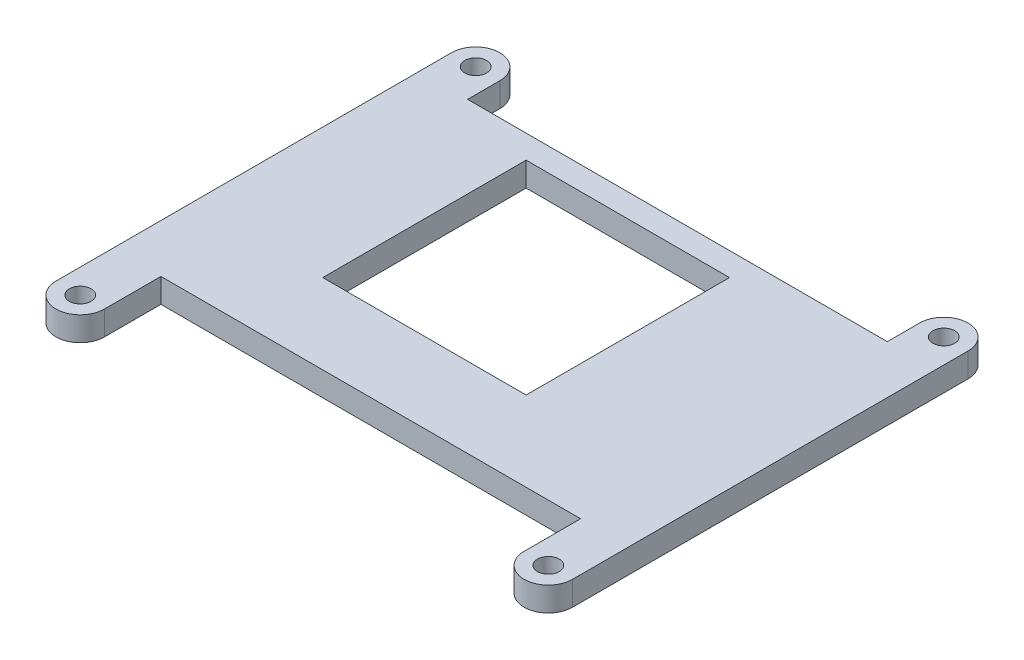
ISO-10303-21;
HEADER;
FILE_DESCRIPTION(('STEP AP214'),'2;1');
FILE_NAME('part.step','',(''),(''),'','','');
FILE_SCHEMA(('AUTOMOTIVE_DESIGN { 1 0 10303 214 1 1 1 1 }'));
ENDSEC;
DATA;
#1=APPLICATION_CONTEXT('core data for automotive mechanical design processes');
#2=APPLICATION_PROTOCOL_DEFINITION('international standard','automotive_design',2000,#1);
#3=PRODUCT_CONTEXT('',#1,'mechanical');
#4=PRODUCT('Part','Part','',(#3));
#5=PRODUCT_RELATED_PRODUCT_CATEGORY('part','',(#4));
#6=PRODUCT_DEFINITION_FORMATION('','',#4);
#7=PRODUCT_DEFINITION_CONTEXT('part definition',#1,'design');
#8=PRODUCT_DEFINITION('design','',#6,#7);
#9=PRODUCT_DEFINITION_SHAPE('','',#8);
#10=(LENGTH_UNIT() NAMED_UNIT(*) SI_UNIT(.MILLI.,.METRE.));
#11=(NAMED_UNIT(*) PLANE_ANGLE_UNIT() SI_UNIT($,.RADIAN.));
#12=(NAMED_UNIT(*) SI_UNIT($,.STERADIAN.) SOLID_ANGLE_UNIT());
#13=UNCERTAINTY_MEASURE_WITH_UNIT(LENGTH_MEASURE(1.E-05),#10,'distance_accuracy_value','');
#14=(GEOMETRIC_REPRESENTATION_CONTEXT(3) GLOBAL_UNCERTAINTY_ASSIGNED_CONTEXT((#13)) GLOBAL_UNIT_ASSIGNED_CONTEXT((#10,
#11,#12)) REPRESENTATION_CONTEXT('',''));
#15=CARTESIAN_POINT('',(0.,0.,0.));
#16=DIRECTION('',(0.,0.,1.));
#17=DIRECTION('',(1.,0.,0.));
#18=AXIS2_PLACEMENT_3D('',#15,#16,#17);
#19=CARTESIAN_POINT('',(-25.75,3.,-19.5));
#20=DIRECTION('',(0.,1.,0.));
#21=DIRECTION('',(0.,0.,1.));
#22=AXIS2_PLACEMENT_3D('',#19,#20,#21);
#23=PLANE('',#22);
#24=CARTESIAN_POINT('',(32.25,3.,-19.5));
#25=DIRECTION('',(0.,1.,0.));
#26=DIRECTION('',(0.,0.,1.));
#27=AXIS2_PLACEMENT_3D('',#24,#25,#26);
#28=CIRCLE('',#27,1.35);
#29=CARTESIAN_POINT('',(32.25,3.,-18.15));
#30=VERTEX_POINT('',#29);
#31=EDGE_CURVE('E527',#30,#30,#28,.T.);
#32=ORIENTED_EDGE('',*,*,#31,.F.);
#33=EDGE_LOOP('',(#32));
#34=FACE_BOUND('',#33,.T.);
#35=CARTESIAN_POINT('',(-25.75,3.,-19.5));
#36=DIRECTION('',(0.,1.,0.));
#37=DIRECTION('',(0.,0.,1.));
#38=AXIS2_PLACEMENT_3D('',#35,#36,#37);
#39=CIRCLE('',#38,1.35);
#40=CARTESIAN_POINT('',(-25.75,3.,-18.15));
#41=VERTEX_POINT('',#40);
#42=EDGE_CURVE('E177',#41,#41,#39,.T.);
#43=ORIENTED_EDGE('',*,*,#42,.F.);
#44=EDGE_LOOP('',(#43));
#45=FACE_BOUND('',#44,.T.);
#46=CARTESIAN_POINT('',(-25.75,3.,-19.5));
#47=DIRECTION('',(0.,1.,0.));
#48=DIRECTION('',(0.,0.,1.));
#49=AXIS2_PLACEMENT_3D('',#46,#47,#48);
#50=CIRCLE('',#49,3.00000000000001);
#51=CARTESIAN_POINT('',(-22.75,3.,-19.5));
#52=VERTEX_POINT('',#51);
#53=CARTESIAN_POINT('',(-28.75,3.,-19.5));
#54=VERTEX_POINT('',#53);
#55=EDGE_CURVE('E187',#52,#54,#50,.T.);
#56=ORIENTED_EDGE('',*,*,#55,.T.);
#57=DIRECTION('',(0.,0.,1.));
#58=VECTOR('',#57,1.);
#59=CARTESIAN_POINT('',(-28.75,3.,-19.5));
#60=LINE('',#59,#58);
#61=CARTESIAN_POINT('',(-28.75,3.,29.5));
#62=VERTEX_POINT('',#61);
#63=EDGE_CURVE('E190',#54,#62,#60,.T.);
#64=ORIENTED_EDGE('',*,*,#63,.T.);
#65=CARTESIAN_POINT('',(-25.75,3.,29.5));
#66=DIRECTION('',(0.,1.,0.));
#67=DIRECTION('',(0.,0.,1.));
#68=AXIS2_PLACEMENT_3D('',#65,#66,#67);
#69=CIRCLE('',#68,3.);
#70=CARTESIAN_POINT('',(-22.75,3.,29.5));
#71=VERTEX_POINT('',#70);
#72=EDGE_CURVE('E193',#62,#71,#69,.T.);
#73=ORIENTED_EDGE('',*,*,#72,.T.);
#74=DIRECTION('',(0.,0.,-1.));
#75=VECTOR('',#74,1.);
#76=CARTESIAN_POINT('',(-22.75,3.,29.5));
#77=LINE('',#76,#75);
#78=CARTESIAN_POINT('',(-22.75,3.,22.5));
#79=VERTEX_POINT('',#78);
#80=EDGE_CURVE('E195',#71,#79,#77,.T.);
#81=ORIENTED_EDGE('',*,*,#80,.T.);
#82=DIRECTION('',(1.,0.,0.));
#83=VECTOR('',#82,1.);
#84=CARTESIAN_POINT('',(-22.75,3.,22.5));
#85=LINE('',#84,#83);
#86=CARTESIAN_POINT('',(29.25,3.,22.5));
#87=VERTEX_POINT('',#86);
#88=EDGE_CURVE('E197',#79,#87,#85,.T.);
#89=ORIENTED_EDGE('',*,*,#88,.T.);
#90=DIRECTION('',(0.,0.,1.));
#91=VECTOR('',#90,1.);
#92=CARTESIAN_POINT('',(29.25,3.,22.5));
#93=LINE('',#92,#91);
#94=CARTESIAN_POINT('',(29.25,3.,29.5));
#95=VERTEX_POINT('',#94);
#96=EDGE_CURVE('E199',#87,#95,#93,.T.);
#97=ORIENTED_EDGE('',*,*,#96,.T.);
#98=CARTESIAN_POINT('',(32.25,3.,29.5));
#99=DIRECTION('',(0.,1.,0.));
#100=DIRECTION('',(0.,0.,1.));
#101=AXIS2_PLACEMENT_3D('',#98,#99,#100);
#102=CIRCLE('',#101,3.);
#103=CARTESIAN_POINT('',(35.25,3.,29.5));
#104=VERTEX_POINT('',#103);
#105=EDGE_CURVE('E201',#95,#104,#102,.T.);
#106=ORIENTED_EDGE('',*,*,#105,.T.);
#107=DIRECTION('',(0.,0.,-1.));
#108=VECTOR('',#107,1.);
#109=CARTESIAN_POINT('',(35.25,3.,-19.5));
#110=LINE('',#109,#108);
#111=CARTESIAN_POINT('',(35.25,3.,-19.5));
#112=VERTEX_POINT('',#111);
#113=EDGE_CURVE('E203',#104,#112,#110,.T.);
#114=ORIENTED_EDGE('',*,*,#113,.T.);
#115=CARTESIAN_POINT('',(32.25,3.,-19.5));
#116=DIRECTION('',(0.,1.,0.));
#117=DIRECTION('',(0.,0.,1.));
#118=AXIS2_PLACEMENT_3D('',#115,#116,#117);
#119=CIRCLE('',#118,2.99999999999999);
#120=CARTESIAN_POINT('',(29.25,3.,-19.5));
#121=VERTEX_POINT('',#120);
#122=EDGE_CURVE('E205',#112,#121,#119,.T.);
#123=ORIENTED_EDGE('',*,*,#122,.T.);
#124=DIRECTION('',(0.,0.,1.));
#125=VECTOR('',#124,1.);
#126=CARTESIAN_POINT('',(29.25,3.,-15.5));
#127=LINE('',#126,#125);
#128=CARTESIAN_POINT('',(29.25,3.,-15.5));
#129=VERTEX_POINT('',#128);
#130=EDGE_CURVE('E207',#121,#129,#127,.T.);
#131=ORIENTED_EDGE('',*,*,#130,.T.);
#132=DIRECTION('',(-1.,0.,0.));
#133=VECTOR('',#132,1.);
#134=CARTESIAN_POINT('',(-22.75,3.,-15.5));
#135=LINE('',#134,#133);
#136=CARTESIAN_POINT('',(-22.75,3.,-15.5));
#137=VERTEX_POINT('',#136);
#138=EDGE_CURVE('E209',#129,#137,#135,.T.);
#139=ORIENTED_EDGE('',*,*,#138,.T.);
#140=DIRECTION('',(0.,0.,-1.));
#141=VECTOR('',#140,1.);
#142=CARTESIAN_POINT('',(-22.75,3.,-15.5));
#143=LINE('',#142,#141);
#144=EDGE_CURVE('E211',#137,#52,#143,.T.);
#145=ORIENTED_EDGE('',*,*,#144,.T.);
#146=EDGE_LOOP('',(#56,#64,#73,#81,#89,#97,#106,#114,#123,#131,#139,#145));
#147=FACE_BOUND('',#146,.T.);
#148=DIRECTION('',(1.,0.,0.));
#149=VECTOR('',#148,1.);
#150=CARTESIAN_POINT('',(-12.6,3.,12.6));
#151=LINE('',#150,#149);
#152=CARTESIAN_POINT('',(-12.6,3.,12.6));
#153=VERTEX_POINT('',#152);
#154=CARTESIAN_POINT('',(12.6,3.,12.6));
#155=VERTEX_POINT('',#154);
#156=EDGE_CURVE('E156',#153,#155,#151,.T.);
#157=ORIENTED_EDGE('',*,*,#156,.F.);
#158=DIRECTION('',(0.,0.,1.));
#159=VECTOR('',#158,1.);
#160=CARTESIAN_POINT('',(-12.6,3.,-12.6));
#161=LINE('',#160,#159);
#162=CARTESIAN_POINT('',(-12.6,3.,-12.6));
#163=VERTEX_POINT('',#162);
#164=EDGE_CURVE('E148',#163,#153,#161,.T.);
#165=ORIENTED_EDGE('',*,*,#164,.F.);
#166=DIRECTION('',(-1.,0.,0.));
#167=VECTOR('',#166,1.);
#168=CARTESIAN_POINT('',(-12.6,3.,-12.6));
#169=LINE('',#168,#167);
#170=CARTESIAN_POINT('',(12.6,3.,-12.6));
#171=VERTEX_POINT('',#170);
#172=EDGE_CURVE('E171',#171,#163,#169,.T.);
#173=ORIENTED_EDGE('',*,*,#172,.F.);
#174=DIRECTION('',(0.,0.,-1.));
#175=VECTOR('',#174,1.);
#176=CARTESIAN_POINT('',(12.6,3.,-12.6));
#177=LINE('',#176,#175);
#178=EDGE_CURVE('E169',#155,#171,#177,.T.);
#179=ORIENTED_EDGE('',*,*,#178,.F.);
#180=EDGE_LOOP('',(#157,#165,#173,#179));
#181=FACE_BOUND('',#180,.T.);
#182=CARTESIAN_POINT('',(-25.75,3.,29.5));
#183=DIRECTION('',(0.,1.,0.));
#184=DIRECTION('',(0.,0.,1.));
#185=AXIS2_PLACEMENT_3D('',#182,#183,#184);
#186=CIRCLE('',#185,1.35);
#187=CARTESIAN_POINT('',(-25.75,3.,30.85));
#188=VERTEX_POINT('',#187);
#189=EDGE_CURVE('E533',#188,#188,#186,.T.);
#190=ORIENTED_EDGE('',*,*,#189,.F.);
#191=EDGE_LOOP('',(#190));
#192=FACE_BOUND('',#191,.T.);
#193=CARTESIAN_POINT('',(32.25,3.,29.5));
#194=DIRECTION('',(0.,1.,0.));
#195=DIRECTION('',(0.,0.,1.));
#196=AXIS2_PLACEMENT_3D('',#193,#194,#195);
#197=CIRCLE('',#196,1.35);
#198=CARTESIAN_POINT('',(32.25,3.,30.85));
#199=VERTEX_POINT('',#198);
#200=EDGE_CURVE('E518',#199,#199,#197,.T.);
#201=ORIENTED_EDGE('',*,*,#200,.F.);
#202=EDGE_LOOP('',(#201));
#203=FACE_BOUND('',#202,.T.);
#204=ADVANCED_FACE('F35',(#34,#45,#147,#181,#192,#203),#23,.T.);
#205=CARTESIAN_POINT('',(-25.75,0.,-19.5));
#206=DIRECTION('',(0.,1.,0.));
#207=DIRECTION('',(0.,0.,1.));
#208=AXIS2_PLACEMENT_3D('',#205,#206,#207);
#209=PLANE('',#208);
#210=CARTESIAN_POINT('',(-25.75,0.,-19.5));
#211=DIRECTION('',(0.,1.,0.));
#212=DIRECTION('',(0.,0.,1.));
#213=AXIS2_PLACEMENT_3D('',#210,#211,#212);
#214=CIRCLE('',#213,3.00000000000001);
#215=CARTESIAN_POINT('',(-22.75,0.,-19.5));
#216=VERTEX_POINT('',#215);
#217=CARTESIAN_POINT('',(-28.75,0.,-19.5));
#218=VERTEX_POINT('',#217);
#219=EDGE_CURVE('E164',#216,#218,#214,.T.);
#220=ORIENTED_EDGE('',*,*,#219,.F.);
#221=DIRECTION('',(0.,0.,-1.));
#222=VECTOR('',#221,1.);
#223=CARTESIAN_POINT('',(-22.75,0.,-15.5));
#224=LINE('',#223,#222);
#225=CARTESIAN_POINT('',(-22.75,0.,-15.5));
#226=VERTEX_POINT('',#225);
#227=EDGE_CURVE('E191',#226,#216,#224,.T.);
#228=ORIENTED_EDGE('',*,*,#227,.F.);
#229=DIRECTION('',(-1.,0.,0.));
#230=VECTOR('',#229,1.);
#231=CARTESIAN_POINT('',(-22.75,0.,-15.5));
#232=LINE('',#231,#230);
#233=CARTESIAN_POINT('',(29.25,0.,-15.5));
#234=VERTEX_POINT('',#233);
#235=EDGE_CURVE('E234',#234,#226,#232,.T.);
#236=ORIENTED_EDGE('',*,*,#235,.F.);
#237=DIRECTION('',(0.,0.,1.));
#238=VECTOR('',#237,1.);
#239=CARTESIAN_POINT('',(29.25,0.,-15.5));
#240=LINE('',#239,#238);
#241=CARTESIAN_POINT('',(29.25,0.,-19.5));
#242=VERTEX_POINT('',#241);
#243=EDGE_CURVE('E232',#242,#234,#240,.T.);
#244=ORIENTED_EDGE('',*,*,#243,.F.);
#245=CARTESIAN_POINT('',(32.25,0.,-19.5));
#246=DIRECTION('',(0.,1.,0.));
#247=DIRECTION('',(0.,0.,1.));
#248=AXIS2_PLACEMENT_3D('',#245,#246,#247);
#249=CIRCLE('',#248,2.99999999999999);
#250=CARTESIAN_POINT('',(35.25,0.,-19.5));
#251=VERTEX_POINT('',#250);
#252=EDGE_CURVE('E230',#251,#242,#249,.T.);
#253=ORIENTED_EDGE('',*,*,#252,.F.);
#254=DIRECTION('',(0.,0.,-1.));
#255=VECTOR('',#254,1.);
#256=CARTESIAN_POINT('',(35.25,0.,-19.5));
#257=LINE('',#256,#255);
#258=CARTESIAN_POINT('',(35.25,0.,29.5));
#259=VERTEX_POINT('',#258);
#260=EDGE_CURVE('E228',#259,#251,#257,.T.);
#261=ORIENTED_EDGE('',*,*,#260,.F.);
#262=CARTESIAN_POINT('',(32.25,0.,29.5));
#263=DIRECTION('',(0.,1.,0.));
#264=DIRECTION('',(0.,0.,1.));
#265=AXIS2_PLACEMENT_3D('',#262,#263,#264);
#266=CIRCLE('',#265,3.);
#267=CARTESIAN_POINT('',(29.25,0.,29.5));
#268=VERTEX_POINT('',#267);
#269=EDGE_CURVE('E226',#268,#259,#266,.T.);
#270=ORIENTED_EDGE('',*,*,#269,.F.);
#271=DIRECTION('',(0.,0.,1.));
#272=VECTOR('',#271,1.);
#273=CARTESIAN_POINT('',(29.25,0.,22.5));
#274=LINE('',#273,#272);
#275=CARTESIAN_POINT('',(29.25,0.,22.5));
#276=VERTEX_POINT('',#275);
#277=EDGE_CURVE('E224',#276,#268,#274,.T.);
#278=ORIENTED_EDGE('',*,*,#277,.F.);
#279=DIRECTION('',(1.,0.,0.));
#280=VECTOR('',#279,1.);
#281=CARTESIAN_POINT('',(-22.75,0.,22.5));
#282=LINE('',#281,#280);
#283=CARTESIAN_POINT('',(-22.75,0.,22.5));
#284=VERTEX_POINT('',#283);
#285=EDGE_CURVE('E222',#284,#276,#282,.T.);
#286=ORIENTED_EDGE('',*,*,#285,.F.);
#287=DIRECTION('',(0.,0.,-1.));
#288=VECTOR('',#287,1.);
#289=CARTESIAN_POINT('',(-22.75,0.,29.5));
#290=LINE('',#289,#288);
#291=CARTESIAN_POINT('',(-22.75,0.,29.5));
#292=VERTEX_POINT('',#291);
#293=EDGE_CURVE('E220',#292,#284,#290,.T.);
#294=ORIENTED_EDGE('',*,*,#293,.F.);
#295=CARTESIAN_POINT('',(-25.75,0.,29.5));
#296=DIRECTION('',(0.,1.,0.));
#297=DIRECTION('',(0.,0.,1.));
#298=AXIS2_PLACEMENT_3D('',#295,#296,#297);
#299=CIRCLE('',#298,3.);
#300=CARTESIAN_POINT('',(-28.75,0.,29.5));
#301=VERTEX_POINT('',#300);
#302=EDGE_CURVE('E218',#301,#292,#299,.T.);
#303=ORIENTED_EDGE('',*,*,#302,.F.);
#304=DIRECTION('',(0.,0.,1.));
#305=VECTOR('',#304,1.);
#306=CARTESIAN_POINT('',(-28.75,0.,-19.5));
#307=LINE('',#306,#305);
#308=EDGE_CURVE('E216',#218,#301,#307,.T.);
#309=ORIENTED_EDGE('',*,*,#308,.F.);
#310=EDGE_LOOP('',(#220,#228,#236,#244,#253,#261,#270,#278,#286,#294,#303,#309));
#311=FACE_BOUND('',#310,.T.);
#312=DIRECTION('',(0.,0.,1.));
#313=VECTOR('',#312,1.);
#314=CARTESIAN_POINT('',(-12.6,0.,-12.6));
#315=LINE('',#314,#313);
#316=CARTESIAN_POINT('',(-12.6,0.,-12.6));
#317=VERTEX_POINT('',#316);
#318=CARTESIAN_POINT('',(-12.6,0.,12.6));
#319=VERTEX_POINT('',#318);
#320=EDGE_CURVE('E58',#317,#319,#315,.T.);
#321=ORIENTED_EDGE('',*,*,#320,.T.);
#322=DIRECTION('',(1.,0.,0.));
#323=VECTOR('',#322,1.);
#324=CARTESIAN_POINT('',(-12.6,0.,12.6));
#325=LINE('',#324,#323);
#326=CARTESIAN_POINT('',(12.6,0.,12.6));
#327=VERTEX_POINT('',#326);
#328=EDGE_CURVE('E163',#319,#327,#325,.T.);
#329=ORIENTED_EDGE('',*,*,#328,.T.);
#330=DIRECTION('',(0.,0.,-1.));
#331=VECTOR('',#330,1.);
#332=CARTESIAN_POINT('',(12.6,0.,-12.6));
#333=LINE('',#332,#331);
#334=CARTESIAN_POINT('',(12.6,0.,-12.6));
#335=VERTEX_POINT('',#334);
#336=EDGE_CURVE('E179',#327,#335,#333,.T.);
#337=ORIENTED_EDGE('',*,*,#336,.T.);
#338=DIRECTION('',(-1.,0.,0.));
#339=VECTOR('',#338,1.);
#340=CARTESIAN_POINT('',(-12.6,0.,-12.6));
#341=LINE('',#340,#339);
#342=EDGE_CURVE('E157',#335,#317,#341,.T.);
#343=ORIENTED_EDGE('',*,*,#342,.T.);
#344=EDGE_LOOP('',(#321,#329,#337,#343));
#345=FACE_BOUND('',#344,.T.);
#346=CARTESIAN_POINT('',(-25.75,0.,-19.5));
#347=DIRECTION('',(0.,1.,0.));
#348=DIRECTION('',(0.,0.,1.));
#349=AXIS2_PLACEMENT_3D('',#346,#347,#348);
#350=CIRCLE('',#349,1.35);
#351=CARTESIAN_POINT('',(-25.75,0.,-18.15));
#352=VERTEX_POINT('',#351);
#353=EDGE_CURVE('E536',#352,#352,#350,.T.);
#354=ORIENTED_EDGE('',*,*,#353,.T.);
#355=EDGE_LOOP('',(#354));
#356=FACE_BOUND('',#355,.T.);
#357=CARTESIAN_POINT('',(-25.75,0.,29.5));
#358=DIRECTION('',(0.,1.,0.));
#359=DIRECTION('',(0.,0.,1.));
#360=AXIS2_PLACEMENT_3D('',#357,#358,#359);
#361=CIRCLE('',#360,1.35);
#362=CARTESIAN_POINT('',(-25.75,0.,30.85));
#363=VERTEX_POINT('',#362);
#364=EDGE_CURVE('E530',#363,#363,#361,.T.);
#365=ORIENTED_EDGE('',*,*,#364,.T.);
#366=EDGE_LOOP('',(#365));
#367=FACE_BOUND('',#366,.T.);
#368=CARTESIAN_POINT('',(32.25,0.,-19.5));
#369=DIRECTION('',(0.,1.,0.));
#370=DIRECTION('',(0.,0.,1.));
#371=AXIS2_PLACEMENT_3D('',#368,#369,#370);
#372=CIRCLE('',#371,1.35);
#373=CARTESIAN_POINT('',(32.25,0.,-18.15));
#374=VERTEX_POINT('',#373);
#375=EDGE_CURVE('E524',#374,#374,#372,.T.);
#376=ORIENTED_EDGE('',*,*,#375,.T.);
#377=EDGE_LOOP('',(#376));
#378=FACE_BOUND('',#377,.T.);
#379=CARTESIAN_POINT('',(32.25,0.,29.5));
#380=DIRECTION('',(0.,1.,0.));
#381=DIRECTION('',(0.,0.,1.));
#382=AXIS2_PLACEMENT_3D('',#379,#380,#381);
#383=CIRCLE('',#382,1.35);
#384=CARTESIAN_POINT('',(32.25,0.,30.85));
#385=VERTEX_POINT('',#384);
#386=EDGE_CURVE('E521',#385,#385,#383,.T.);
#387=ORIENTED_EDGE('',*,*,#386,.T.);
#388=EDGE_LOOP('',(#387));
#389=FACE_BOUND('',#388,.T.);
#390=ADVANCED_FACE('F276',(#311,#345,#356,#367,#378,#389),#209,.F.);
#391=CARTESIAN_POINT('',(-25.75,3.,-19.5));
#392=DIRECTION('',(0.,-1.,0.));
#393=DIRECTION('',(0.,0.,-1.));
#394=AXIS2_PLACEMENT_3D('',#391,#392,#393);
#395=CYLINDRICAL_SURFACE('',#394,3.00000000000001);
#396=ORIENTED_EDGE('',*,*,#219,.T.);
#397=DIRECTION('',(0.,-1.,0.));
#398=VECTOR('',#397,1.);
#399=CARTESIAN_POINT('',(-28.75,3.,-19.5));
#400=LINE('',#399,#398);
#401=EDGE_CURVE('E11',#54,#218,#400,.T.);
#402=ORIENTED_EDGE('',*,*,#401,.F.);
#403=ORIENTED_EDGE('',*,*,#55,.F.);
#404=DIRECTION('',(0.,-1.,0.));
#405=VECTOR('',#404,1.);
#406=CARTESIAN_POINT('',(-22.75,3.,-19.5));
#407=LINE('',#406,#405);
#408=EDGE_CURVE('E213',#52,#216,#407,.T.);
#409=ORIENTED_EDGE('',*,*,#408,.T.);
#410=EDGE_LOOP('',(#396,#402,#403,#409));
#411=FACE_BOUND('',#410,.T.);
#412=ADVANCED_FACE('F37',(#411),#395,.T.);
#413=CARTESIAN_POINT('',(-28.75,3.,-19.5));
#414=DIRECTION('',(1.,0.,0.));
#415=DIRECTION('',(0.,0.,-1.));
#416=AXIS2_PLACEMENT_3D('',#413,#414,#415);
#417=PLANE('',#416);
#418=ORIENTED_EDGE('',*,*,#308,.T.);
#419=DIRECTION('',(0.,-1.,0.));
#420=VECTOR('',#419,1.);
#421=CARTESIAN_POINT('',(-28.75,3.,29.5));
#422=LINE('',#421,#420);
#423=EDGE_CURVE('E43',#62,#301,#422,.T.);
#424=ORIENTED_EDGE('',*,*,#423,.F.);
#425=ORIENTED_EDGE('',*,*,#63,.F.);
#426=ORIENTED_EDGE('',*,*,#401,.T.);
#427=EDGE_LOOP('',(#418,#424,#425,#426));
#428=FACE_BOUND('',#427,.T.);
#429=ADVANCED_FACE('F293',(#428),#417,.F.);
#430=CARTESIAN_POINT('',(-25.75,3.,29.5));
#431=DIRECTION('',(0.,-1.,0.));
#432=DIRECTION('',(0.,0.,-1.));
#433=AXIS2_PLACEMENT_3D('',#430,#431,#432);
#434=CYLINDRICAL_SURFACE('',#433,3.);
#435=ORIENTED_EDGE('',*,*,#302,.T.);
#436=DIRECTION('',(0.,-1.,0.));
#437=VECTOR('',#436,1.);
#438=CARTESIAN_POINT('',(-22.75,3.,29.5));
#439=LINE('',#438,#437);
#440=EDGE_CURVE('E263',#71,#292,#439,.T.);
#441=ORIENTED_EDGE('',*,*,#440,.F.);
#442=ORIENTED_EDGE('',*,*,#72,.F.);
#443=ORIENTED_EDGE('',*,*,#423,.T.);
#444=EDGE_LOOP('',(#435,#441,#442,#443));
#445=FACE_BOUND('',#444,.T.);
#446=ADVANCED_FACE('F270',(#445),#434,.T.);
#447=CARTESIAN_POINT('',(-22.75,3.,29.5));
#448=DIRECTION('',(-1.,0.,0.));
#449=DIRECTION('',(0.,0.,1.));
#450=AXIS2_PLACEMENT_3D('',#447,#448,#449);
#451=PLANE('',#450);
#452=ORIENTED_EDGE('',*,*,#293,.T.);
#453=DIRECTION('',(0.,-1.,0.));
#454=VECTOR('',#453,1.);
#455=CARTESIAN_POINT('',(-22.75,3.,22.5));
#456=LINE('',#455,#454);
#457=EDGE_CURVE('E260',#79,#284,#456,.T.);
#458=ORIENTED_EDGE('',*,*,#457,.F.);
#459=ORIENTED_EDGE('',*,*,#80,.F.);
#460=ORIENTED_EDGE('',*,*,#440,.T.);
#461=EDGE_LOOP('',(#452,#458,#459,#460));
#462=FACE_BOUND('',#461,.T.);
#463=ADVANCED_FACE('F282',(#462),#451,.F.);
#464=CARTESIAN_POINT('',(-22.75,3.,22.5));
#465=DIRECTION('',(0.,0.,-1.));
#466=DIRECTION('',(-1.,0.,0.));
#467=AXIS2_PLACEMENT_3D('',#464,#465,#466);
#468=PLANE('',#467);
#469=ORIENTED_EDGE('',*,*,#285,.T.);
#470=DIRECTION('',(0.,-1.,0.));
#471=VECTOR('',#470,1.);
#472=CARTESIAN_POINT('',(29.25,3.,22.5));
#473=LINE('',#472,#471);
#474=EDGE_CURVE('E257',#87,#276,#473,.T.);
#475=ORIENTED_EDGE('',*,*,#474,.F.);
#476=ORIENTED_EDGE('',*,*,#88,.F.);
#477=ORIENTED_EDGE('',*,*,#457,.T.);
#478=EDGE_LOOP('',(#469,#475,#476,#477));
#479=FACE_BOUND('',#478,.T.);
#480=ADVANCED_FACE('F286',(#479),#468,.F.);
#481=CARTESIAN_POINT('',(29.25,3.,22.5));
#482=DIRECTION('',(1.,0.,0.));
#483=DIRECTION('',(0.,0.,-1.));
#484=AXIS2_PLACEMENT_3D('',#481,#482,#483);
#485=PLANE('',#484);
#486=ORIENTED_EDGE('',*,*,#277,.T.);
#487=DIRECTION('',(0.,-1.,0.));
#488=VECTOR('',#487,1.);
#489=CARTESIAN_POINT('',(29.25,3.,29.5));
#490=LINE('',#489,#488);
#491=EDGE_CURVE('E254',#95,#268,#490,.T.);
#492=ORIENTED_EDGE('',*,*,#491,.F.);
#493=ORIENTED_EDGE('',*,*,#96,.F.);
#494=ORIENTED_EDGE('',*,*,#474,.T.);
#495=EDGE_LOOP('',(#486,#492,#493,#494));
#496=FACE_BOUND('',#495,.T.);
#497=ADVANCED_FACE('F326',(#496),#485,.F.);
#498=CARTESIAN_POINT('',(32.25,3.,29.5));
#499=DIRECTION('',(0.,-1.,0.));
#500=DIRECTION('',(0.,0.,-1.));
#501=AXIS2_PLACEMENT_3D('',#498,#499,#500);
#502=CYLINDRICAL_SURFACE('',#501,3.);
#503=ORIENTED_EDGE('',*,*,#269,.T.);
#504=DIRECTION('',(0.,-1.,0.));
#505=VECTOR('',#504,1.);
#506=CARTESIAN_POINT('',(35.25,3.,29.5));
#507=LINE('',#506,#505);
#508=EDGE_CURVE('E251',#104,#259,#507,.T.);
#509=ORIENTED_EDGE('',*,*,#508,.F.);
#510=ORIENTED_EDGE('',*,*,#105,.F.);
#511=ORIENTED_EDGE('',*,*,#491,.T.);
#512=EDGE_LOOP('',(#503,#509,#510,#511));
#513=FACE_BOUND('',#512,.T.);
#514=ADVANCED_FACE('F324',(#513),#502,.T.);
#515=CARTESIAN_POINT('',(35.25,3.,-19.5));
#516=DIRECTION('',(-1.,0.,0.));
#517=DIRECTION('',(0.,0.,1.));
#518=AXIS2_PLACEMENT_3D('',#515,#516,#517);
#519=PLANE('',#518);
#520=ORIENTED_EDGE('',*,*,#260,.T.);
#521=DIRECTION('',(0.,-1.,0.));
#522=VECTOR('',#521,1.);
#523=CARTESIAN_POINT('',(35.25,3.,-19.5));
#524=LINE('',#523,#522);
#525=EDGE_CURVE('E248',#112,#251,#524,.T.);
#526=ORIENTED_EDGE('',*,*,#525,.F.);
#527=ORIENTED_EDGE('',*,*,#113,.F.);
#528=ORIENTED_EDGE('',*,*,#508,.T.);
#529=EDGE_LOOP('',(#520,#526,#527,#528));
#530=FACE_BOUND('',#529,.T.);
#531=ADVANCED_FACE('F320',(#530),#519,.F.);
#532=CARTESIAN_POINT('',(32.25,3.,-19.5));
#533=DIRECTION('',(0.,-1.,0.));
#534=DIRECTION('',(0.,0.,-1.));
#535=AXIS2_PLACEMENT_3D('',#532,#533,#534);
#536=CYLINDRICAL_SURFACE('',#535,2.99999999999999);
#537=ORIENTED_EDGE('',*,*,#252,.T.);
#538=DIRECTION('',(0.,-1.,0.));
#539=VECTOR('',#538,1.);
#540=CARTESIAN_POINT('',(29.25,3.,-19.5));
#541=LINE('',#540,#539);
#542=EDGE_CURVE('E245',#121,#242,#541,.T.);
#543=ORIENTED_EDGE('',*,*,#542,.F.);
#544=ORIENTED_EDGE('',*,*,#122,.F.);
#545=ORIENTED_EDGE('',*,*,#525,.T.);
#546=EDGE_LOOP('',(#537,#543,#544,#545));
#547=FACE_BOUND('',#546,.T.);
#548=ADVANCED_FACE('F315',(#547),#536,.T.);
#549=CARTESIAN_POINT('',(29.25,3.,-15.5));
#550=DIRECTION('',(1.,0.,0.));
#551=DIRECTION('',(0.,0.,-1.));
#552=AXIS2_PLACEMENT_3D('',#549,#550,#551);
#553=PLANE('',#552);
#554=ORIENTED_EDGE('',*,*,#243,.T.);
#555=DIRECTION('',(0.,-1.,0.));
#556=VECTOR('',#555,1.);
#557=CARTESIAN_POINT('',(29.25,3.,-15.5));
#558=LINE('',#557,#556);
#559=EDGE_CURVE('E242',#129,#234,#558,.T.);
#560=ORIENTED_EDGE('',*,*,#559,.F.);
#561=ORIENTED_EDGE('',*,*,#130,.F.);
#562=ORIENTED_EDGE('',*,*,#542,.T.);
#563=EDGE_LOOP('',(#554,#560,#561,#562));
#564=FACE_BOUND('',#563,.T.);
#565=ADVANCED_FACE('F309',(#564),#553,.F.);
#566=CARTESIAN_POINT('',(-22.75,3.,-15.5));
#567=DIRECTION('',(0.,0.,1.));
#568=DIRECTION('',(1.,0.,0.));
#569=AXIS2_PLACEMENT_3D('',#566,#567,#568);
#570=PLANE('',#569);
#571=ORIENTED_EDGE('',*,*,#235,.T.);
#572=DIRECTION('',(0.,-1.,0.));
#573=VECTOR('',#572,1.);
#574=CARTESIAN_POINT('',(-22.75,3.,-15.5));
#575=LINE('',#574,#573);
#576=EDGE_CURVE('E239',#137,#226,#575,.T.);
#577=ORIENTED_EDGE('',*,*,#576,.F.);
#578=ORIENTED_EDGE('',*,*,#138,.F.);
#579=ORIENTED_EDGE('',*,*,#559,.T.);
#580=EDGE_LOOP('',(#571,#577,#578,#579));
#581=FACE_BOUND('',#580,.T.);
#582=ADVANCED_FACE('F305',(#581),#570,.F.);
#583=CARTESIAN_POINT('',(-22.75,3.,-15.5));
#584=DIRECTION('',(-1.,0.,0.));
#585=DIRECTION('',(0.,0.,1.));
#586=AXIS2_PLACEMENT_3D('',#583,#584,#585);
#587=PLANE('',#586);
#588=ORIENTED_EDGE('',*,*,#227,.T.);
#589=ORIENTED_EDGE('',*,*,#408,.F.);
#590=ORIENTED_EDGE('',*,*,#144,.F.);
#591=ORIENTED_EDGE('',*,*,#576,.T.);
#592=EDGE_LOOP('',(#588,#589,#590,#591));
#593=FACE_BOUND('',#592,.T.);
#594=ADVANCED_FACE('F300',(#593),#587,.F.);
#595=CARTESIAN_POINT('',(-12.6,3.,-12.6));
#596=DIRECTION('',(1.,0.,0.));
#597=DIRECTION('',(0.,0.,-1.));
#598=AXIS2_PLACEMENT_3D('',#595,#596,#597);
#599=PLANE('',#598);
#600=ORIENTED_EDGE('',*,*,#320,.F.);
#601=DIRECTION('',(0.,-1.,0.));
#602=VECTOR('',#601,1.);
#603=CARTESIAN_POINT('',(-12.6,3.,-12.6));
#604=LINE('',#603,#602);
#605=EDGE_CURVE('E152',#163,#317,#604,.T.);
#606=ORIENTED_EDGE('',*,*,#605,.F.);
#607=ORIENTED_EDGE('',*,*,#164,.T.);
#608=DIRECTION('',(0.,-1.,0.));
#609=VECTOR('',#608,1.);
#610=CARTESIAN_POINT('',(-12.6,3.,12.6));
#611=LINE('',#610,#609);
#612=EDGE_CURVE('E151',#153,#319,#611,.T.);
#613=ORIENTED_EDGE('',*,*,#612,.T.);
#614=EDGE_LOOP('',(#600,#606,#607,#613));
#615=FACE_BOUND('',#614,.T.);
#616=ADVANCED_FACE('F150',(#615),#599,.T.);
#617=CARTESIAN_POINT('',(-12.6,3.,12.6));
#618=DIRECTION('',(0.,0.,-1.));
#619=DIRECTION('',(-1.,0.,0.));
#620=AXIS2_PLACEMENT_3D('',#617,#618,#619);
#621=PLANE('',#620);
#622=ORIENTED_EDGE('',*,*,#328,.F.);
#623=ORIENTED_EDGE('',*,*,#612,.F.);
#624=ORIENTED_EDGE('',*,*,#156,.T.);
#625=DIRECTION('',(0.,-1.,0.));
#626=VECTOR('',#625,1.);
#627=CARTESIAN_POINT('',(12.6,3.,12.6));
#628=LINE('',#627,#626);
#629=EDGE_CURVE('E165',#155,#327,#628,.T.);
#630=ORIENTED_EDGE('',*,*,#629,.T.);
#631=EDGE_LOOP('',(#622,#623,#624,#630));
#632=FACE_BOUND('',#631,.T.);
#633=ADVANCED_FACE('F160',(#632),#621,.T.);
#634=CARTESIAN_POINT('',(12.6,3.,-12.6));
#635=DIRECTION('',(-1.,0.,0.));
#636=DIRECTION('',(0.,0.,1.));
#637=AXIS2_PLACEMENT_3D('',#634,#635,#636);
#638=PLANE('',#637);
#639=ORIENTED_EDGE('',*,*,#336,.F.);
#640=ORIENTED_EDGE('',*,*,#629,.F.);
#641=ORIENTED_EDGE('',*,*,#178,.T.);
#642=DIRECTION('',(0.,-1.,0.));
#643=VECTOR('',#642,1.);
#644=CARTESIAN_POINT('',(12.6,3.,-12.6));
#645=LINE('',#644,#643);
#646=EDGE_CURVE('E50',#171,#335,#645,.T.);
#647=ORIENTED_EDGE('',*,*,#646,.T.);
#648=EDGE_LOOP('',(#639,#640,#641,#647));
#649=FACE_BOUND('',#648,.T.);
#650=ADVANCED_FACE('F387',(#649),#638,.T.);
#651=CARTESIAN_POINT('',(-12.6,3.,-12.6));
#652=DIRECTION('',(0.,0.,1.));
#653=DIRECTION('',(1.,0.,0.));
#654=AXIS2_PLACEMENT_3D('',#651,#652,#653);
#655=PLANE('',#654);
#656=ORIENTED_EDGE('',*,*,#342,.F.);
#657=ORIENTED_EDGE('',*,*,#646,.F.);
#658=ORIENTED_EDGE('',*,*,#172,.T.);
#659=ORIENTED_EDGE('',*,*,#605,.T.);
#660=EDGE_LOOP('',(#656,#657,#658,#659));
#661=FACE_BOUND('',#660,.T.);
#662=ADVANCED_FACE('F393',(#661),#655,.T.);
#663=CARTESIAN_POINT('',(-25.75,3.,-19.5));
#664=DIRECTION('',(0.,-1.,0.));
#665=DIRECTION('',(0.,0.,-1.));
#666=AXIS2_PLACEMENT_3D('',#663,#664,#665);
#667=CYLINDRICAL_SURFACE('',#666,1.35);
#668=ORIENTED_EDGE('',*,*,#42,.T.);
#669=EDGE_LOOP('',(#668));
#670=FACE_BOUND('',#669,.T.);
#671=ORIENTED_EDGE('',*,*,#353,.F.);
#672=EDGE_LOOP('',(#671));
#673=FACE_BOUND('',#672,.T.);
#674=ADVANCED_FACE('F401',(#670,#673),#667,.F.);
#675=CARTESIAN_POINT('',(-25.75,3.,29.5));
#676=DIRECTION('',(0.,-1.,0.));
#677=DIRECTION('',(0.,0.,-1.));
#678=AXIS2_PLACEMENT_3D('',#675,#676,#677);
#679=CYLINDRICAL_SURFACE('',#678,1.35);
#680=ORIENTED_EDGE('',*,*,#189,.T.);
#681=EDGE_LOOP('',(#680));
#682=FACE_BOUND('',#681,.T.);
#683=ORIENTED_EDGE('',*,*,#364,.F.);
#684=EDGE_LOOP('',(#683));
#685=FACE_BOUND('',#684,.T.);
#686=ADVANCED_FACE('F408',(#682,#685),#679,.F.);
#687=CARTESIAN_POINT('',(32.25,3.,-19.5));
#688=DIRECTION('',(0.,-1.,0.));
#689=DIRECTION('',(0.,0.,-1.));
#690=AXIS2_PLACEMENT_3D('',#687,#688,#689);
#691=CYLINDRICAL_SURFACE('',#690,1.35);
#692=ORIENTED_EDGE('',*,*,#31,.T.);
#693=EDGE_LOOP('',(#692));
#694=FACE_BOUND('',#693,.T.);
#695=ORIENTED_EDGE('',*,*,#375,.F.);
#696=EDGE_LOOP('',(#695));
#697=FACE_BOUND('',#696,.T.);
#698=ADVANCED_FACE('F416',(#694,#697),#691,.F.);
#699=CARTESIAN_POINT('',(32.25,3.,29.5));
#700=DIRECTION('',(0.,-1.,0.));
#701=DIRECTION('',(0.,0.,-1.));
#702=AXIS2_PLACEMENT_3D('',#699,#700,#701);
#703=CYLINDRICAL_SURFACE('',#702,1.35);
#704=ORIENTED_EDGE('',*,*,#200,.T.);
#705=EDGE_LOOP('',(#704));
#706=FACE_BOUND('',#705,.T.);
#707=ORIENTED_EDGE('',*,*,#386,.F.);
#708=EDGE_LOOP('',(#707));
#709=FACE_BOUND('',#708,.T.);
#710=ADVANCED_FACE('F424',(#706,#709),#703,.F.);
#711=CLOSED_SHELL('',(#204,#390,#412,#429,#446,#463,#480,#497,#514,#531,#548,#565,#582,#594,
#616,#633,#650,#662,#674,#686,#698,#710));
#712=MANIFOLD_SOLID_BREP('B2',#711);
#713=ADVANCED_BREP_SHAPE_REPRESENTATION('',(#18,#712),#14);
#714=SHAPE_DEFINITION_REPRESENTATION(#9,#713);
ENDSEC;
END-ISO-10303-21;
